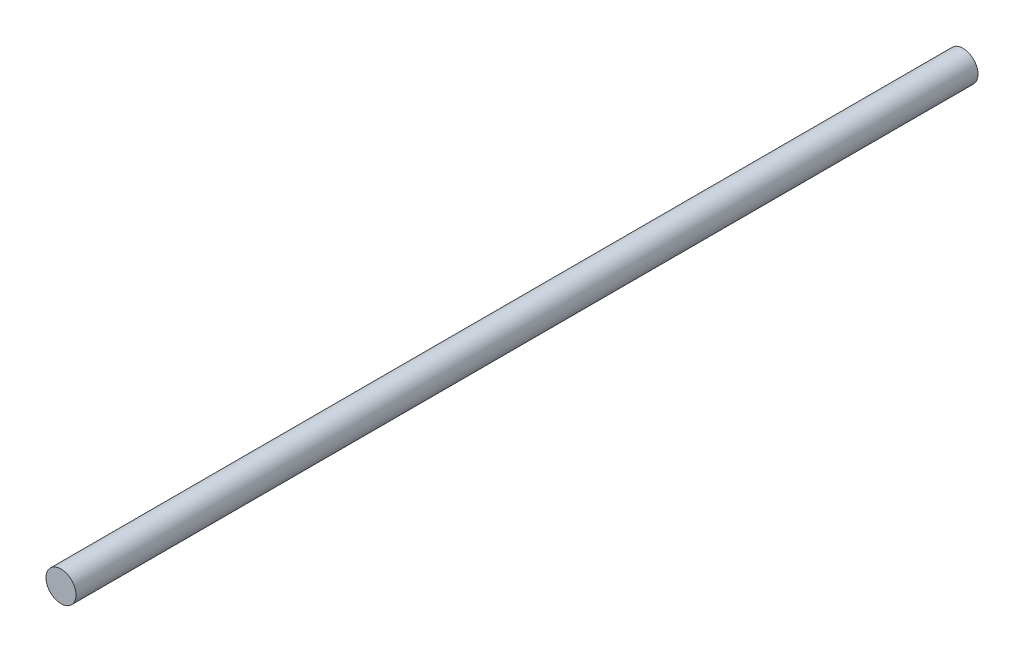
ISO-10303-21;
HEADER;
FILE_DESCRIPTION(('STEP AP214'),'2;1');
FILE_NAME('part.step','',(''),(''),'','','');
FILE_SCHEMA(('AUTOMOTIVE_DESIGN { 1 0 10303 214 1 1 1 1 }'));
ENDSEC;
DATA;
#1=APPLICATION_CONTEXT('core data for automotive mechanical design processes');
#2=APPLICATION_PROTOCOL_DEFINITION('international standard','automotive_design',2000,#1);
#3=PRODUCT_CONTEXT('',#1,'mechanical');
#4=PRODUCT('Part','Part','',(#3));
#5=PRODUCT_RELATED_PRODUCT_CATEGORY('part','',(#4));
#6=PRODUCT_DEFINITION_FORMATION('','',#4);
#7=PRODUCT_DEFINITION_CONTEXT('part definition',#1,'design');
#8=PRODUCT_DEFINITION('design','',#6,#7);
#9=PRODUCT_DEFINITION_SHAPE('','',#8);
#10=(LENGTH_UNIT() NAMED_UNIT(*) SI_UNIT(.MILLI.,.METRE.));
#11=(NAMED_UNIT(*) PLANE_ANGLE_UNIT() SI_UNIT($,.RADIAN.));
#12=(NAMED_UNIT(*) SI_UNIT($,.STERADIAN.) SOLID_ANGLE_UNIT());
#13=UNCERTAINTY_MEASURE_WITH_UNIT(LENGTH_MEASURE(1.E-05),#10,'distance_accuracy_value','');
#14=(GEOMETRIC_REPRESENTATION_CONTEXT(3) GLOBAL_UNCERTAINTY_ASSIGNED_CONTEXT((#13)) GLOBAL_UNIT_ASSIGNED_CONTEXT((#10,
#11,#12)) REPRESENTATION_CONTEXT('',''));
#15=CARTESIAN_POINT('',(0.,0.,0.));
#16=DIRECTION('',(0.,0.,1.));
#17=DIRECTION('',(1.,0.,0.));
#18=AXIS2_PLACEMENT_3D('',#15,#16,#17);
#19=CARTESIAN_POINT('',(0.,0.,45.));
#20=DIRECTION('',(0.,0.,-1.));
#21=DIRECTION('',(-1.,0.,0.));
#22=AXIS2_PLACEMENT_3D('',#19,#20,#21);
#23=CYLINDRICAL_SURFACE('',#22,0.750000000000001);
#24=CARTESIAN_POINT('',(0.,0.,45.));
#25=DIRECTION('',(0.,0.,1.));
#26=DIRECTION('',(1.,0.,0.));
#27=AXIS2_PLACEMENT_3D('',#24,#25,#26);
#28=CIRCLE('',#27,0.750000000000001);
#29=CARTESIAN_POINT('',(0.750000000000001,0.,45.));
#30=VERTEX_POINT('',#29);
#31=EDGE_CURVE('E10',#30,#30,#28,.T.);
#32=ORIENTED_EDGE('',*,*,#31,.F.);
#33=EDGE_LOOP('',(#32));
#34=FACE_BOUND('',#33,.T.);
#35=CARTESIAN_POINT('',(0.,0.,0.));
#36=DIRECTION('',(0.,0.,1.));
#37=DIRECTION('',(1.,0.,0.));
#38=AXIS2_PLACEMENT_3D('',#35,#36,#37);
#39=CIRCLE('',#38,0.750000000000001);
#40=CARTESIAN_POINT('',(0.750000000000001,0.,0.));
#41=VERTEX_POINT('',#40);
#42=EDGE_CURVE('E35',#41,#41,#39,.T.);
#43=ORIENTED_EDGE('',*,*,#42,.T.);
#44=EDGE_LOOP('',(#43));
#45=FACE_BOUND('',#44,.T.);
#46=ADVANCED_FACE('F32',(#34,#45),#23,.T.);
#47=CARTESIAN_POINT('',(0.,0.,45.));
#48=DIRECTION('',(0.,0.,1.));
#49=DIRECTION('',(1.,0.,0.));
#50=AXIS2_PLACEMENT_3D('',#47,#48,#49);
#51=PLANE('',#50);
#52=ORIENTED_EDGE('',*,*,#31,.T.);
#53=EDGE_LOOP('',(#52));
#54=FACE_BOUND('',#53,.T.);
#55=ADVANCED_FACE('F47',(#54),#51,.T.);
#56=CARTESIAN_POINT('',(0.,0.,0.));
#57=DIRECTION('',(0.,0.,1.));
#58=DIRECTION('',(1.,0.,0.));
#59=AXIS2_PLACEMENT_3D('',#56,#57,#58);
#60=PLANE('',#59);
#61=ORIENTED_EDGE('',*,*,#42,.F.);
#62=EDGE_LOOP('',(#61));
#63=FACE_BOUND('',#62,.T.);
#64=ADVANCED_FACE('F45',(#63),#60,.F.);
#65=CLOSED_SHELL('',(#46,#55,#64));
#66=MANIFOLD_SOLID_BREP('B2',#65);
#67=ADVANCED_BREP_SHAPE_REPRESENTATION('',(#18,#66),#14);
#68=SHAPE_DEFINITION_REPRESENTATION(#9,#67);
ENDSEC;
END-ISO-10303-21;
